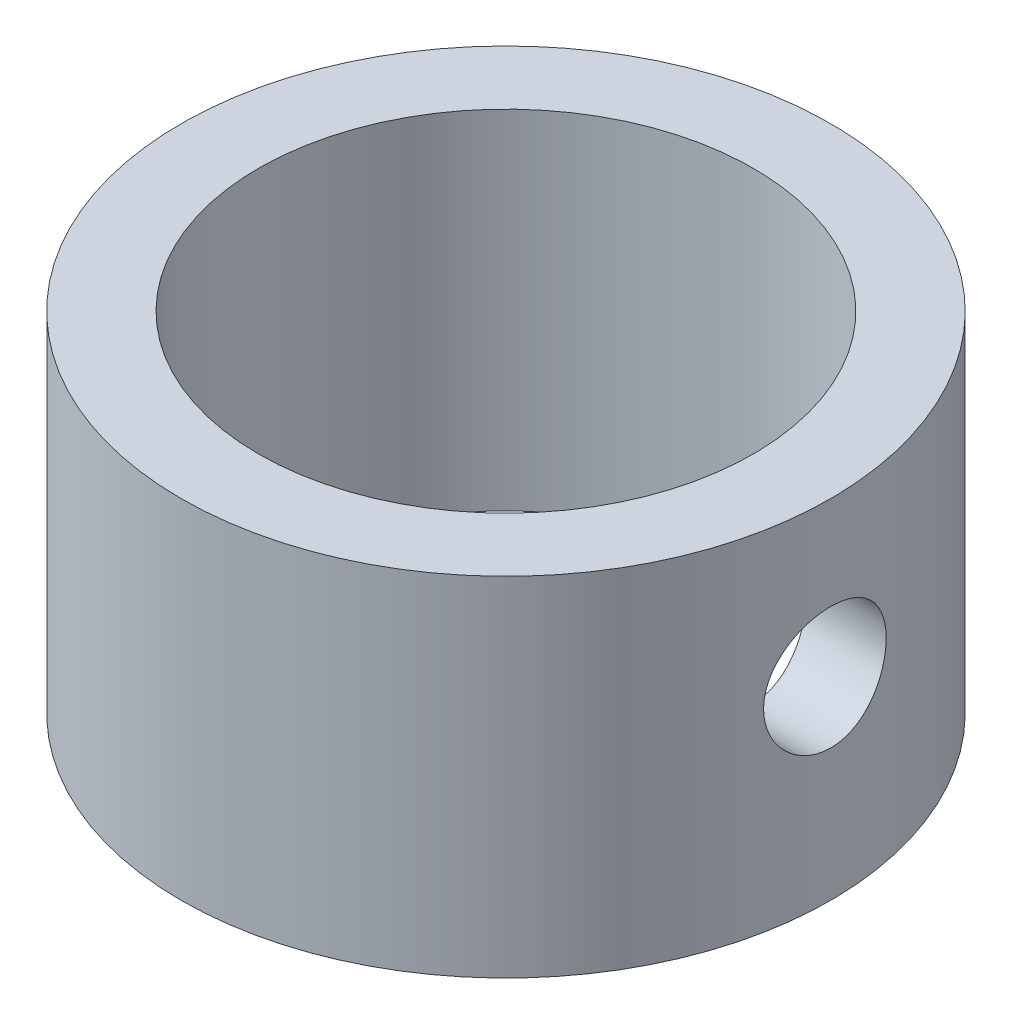
ISO-10303-21;
HEADER;
FILE_DESCRIPTION(('STEP AP214'),'2;1');
FILE_NAME('part.step','',(''),(''),'','','');
FILE_SCHEMA(('AUTOMOTIVE_DESIGN { 1 0 10303 214 1 1 1 1 }'));
ENDSEC;
DATA;
#1=APPLICATION_CONTEXT('core data for automotive mechanical design processes');
#2=APPLICATION_PROTOCOL_DEFINITION('international standard','automotive_design',2000,#1);
#3=PRODUCT_CONTEXT('',#1,'mechanical');
#4=PRODUCT('Part','Part','',(#3));
#5=PRODUCT_RELATED_PRODUCT_CATEGORY('part','',(#4));
#6=PRODUCT_DEFINITION_FORMATION('','',#4);
#7=PRODUCT_DEFINITION_CONTEXT('part definition',#1,'design');
#8=PRODUCT_DEFINITION('design','',#6,#7);
#9=PRODUCT_DEFINITION_SHAPE('','',#8);
#10=(LENGTH_UNIT() NAMED_UNIT(*) SI_UNIT(.MILLI.,.METRE.));
#11=(NAMED_UNIT(*) PLANE_ANGLE_UNIT() SI_UNIT($,.RADIAN.));
#12=(NAMED_UNIT(*) SI_UNIT($,.STERADIAN.) SOLID_ANGLE_UNIT());
#13=UNCERTAINTY_MEASURE_WITH_UNIT(LENGTH_MEASURE(1.E-05),#10,'distance_accuracy_value','');
#14=(GEOMETRIC_REPRESENTATION_CONTEXT(3) GLOBAL_UNCERTAINTY_ASSIGNED_CONTEXT((#13)) GLOBAL_UNIT_ASSIGNED_CONTEXT((#10,
#11,#12)) REPRESENTATION_CONTEXT('',''));
#15=CARTESIAN_POINT('',(0.,0.,0.));
#16=DIRECTION('',(0.,0.,1.));
#17=DIRECTION('',(1.,0.,0.));
#18=AXIS2_PLACEMENT_3D('',#15,#16,#17);
#19=CARTESIAN_POINT('',(0.,-1.25,0.));
#20=DIRECTION('',(0.,1.,0.));
#21=DIRECTION('',(0.,0.,1.));
#22=AXIS2_PLACEMENT_3D('',#19,#20,#21);
#23=CYLINDRICAL_SURFACE('',#22,2.1);
#24=CARTESIAN_POINT('',(2.06227880326594,0.,-0.396239999999993));
#25=CARTESIAN_POINT('',(2.06227923125293,0.0220433662998956,-0.396239157163966));
#26=CARTESIAN_POINT('',(2.06263606892465,0.0440976375763761,-0.394394305189756));
#27=CARTESIAN_POINT('',(2.06402305640468,0.0875841156718688,-0.387068724873467));
#28=CARTESIAN_POINT('',(2.06505377438345,0.109015781612206,-0.3815849283602));
#29=CARTESIAN_POINT('',(2.06766772536739,0.150621551652371,-0.367156018953373));
#30=CARTESIAN_POINT('',(2.06925044034742,0.170796813983742,-0.358214150456265));
#31=CARTESIAN_POINT('',(2.07278943938173,0.209359621584742,-0.33713154405698));
#32=CARTESIAN_POINT('',(2.07474569505206,0.227747302525837,-0.324991049179765));
#33=CARTESIAN_POINT('',(2.07883889070832,0.262446036871845,-0.297692739807474));
#34=CARTESIAN_POINT('',(2.08097762176098,0.278731292379627,-0.28250239734035));
#35=CARTESIAN_POINT('',(2.08517897298424,0.308538085477135,-0.249605888854275));
#36=CARTESIAN_POINT('',(2.08724158812009,0.32205944051432,-0.231899556787864));
#37=CARTESIAN_POINT('',(2.0910775051541,0.346053582309492,-0.194304111970412));
#38=CARTESIAN_POINT('',(2.09284845060321,0.356502028042994,-0.174399203288928));
#39=CARTESIAN_POINT('',(2.09588143610819,0.373896913663685,-0.133077521638642));
#40=CARTESIAN_POINT('',(2.09714351853459,0.380843645133426,-0.111660874719401));
#41=CARTESIAN_POINT('',(2.09900392469389,0.390958087536764,-0.0681910244703867));
#42=CARTESIAN_POINT('',(2.09960988239833,0.394169294501542,-0.0461482737928631));
#43=CARTESIAN_POINT('',(2.10011608130945,0.396857077131275,-0.00182911458913357));
#44=CARTESIAN_POINT('',(2.10001638333999,0.396333974674344,0.0204472736334566));
#45=CARTESIAN_POINT('',(2.09912846524647,0.391601311857938,0.0643030165408468));
#46=CARTESIAN_POINT('',(2.09834899306167,0.387438587646178,0.0858876282365805));
#47=CARTESIAN_POINT('',(2.09619892552423,0.37561894074816,0.128046377394059));
#48=CARTESIAN_POINT('',(2.09482830842762,0.367961889530189,0.148620477655358));
#49=CARTESIAN_POINT('',(2.09163535289751,0.349326432128582,0.188309826742431));
#50=CARTESIAN_POINT('',(2.08981048347841,0.338329337768601,0.207416088923615));
#51=CARTESIAN_POINT('',(2.08591077548498,0.313339736796762,0.243529548239943));
#52=CARTESIAN_POINT('',(2.08383591118947,0.299346921849537,0.260536529021685));
#53=CARTESIAN_POINT('',(2.07962795059652,0.268505098826812,0.292246201810245));
#54=CARTESIAN_POINT('',(2.07749445036021,0.251615114144883,0.30690901262132));
#55=CARTESIAN_POINT('',(2.07344045138472,0.215594805068189,0.333199917006207));
#56=CARTESIAN_POINT('',(2.07151995584133,0.196464447068942,0.344827965051644));
#57=CARTESIAN_POINT('',(2.06810880519369,0.156453147774011,0.364730857662425));
#58=CARTESIAN_POINT('',(2.06661890217287,0.135569224761366,0.372999845302882));
#59=CARTESIAN_POINT('',(2.06424909819484,0.0926740354964583,0.385900388309765));
#60=CARTESIAN_POINT('',(2.06336912717302,0.0706628990424363,0.390532361478425));
#61=CARTESIAN_POINT('',(2.06233269825866,0.0264978949053011,0.395969034907763));
#62=CARTESIAN_POINT('',(2.06216540468268,0.00435133073553325,0.396831059604532));
#63=CARTESIAN_POINT('',(2.06254426774915,-0.0397692751621675,0.394857085827068));
#64=CARTESIAN_POINT('',(2.06309038863542,-0.0617433254809282,0.392021272687679));
#65=CARTESIAN_POINT('',(2.06482444813135,-0.104706292344454,0.382781352369544));
#66=CARTESIAN_POINT('',(2.06600696932093,-0.125701921798904,0.376407350173828));
#67=CARTESIAN_POINT('',(2.06887591390094,-0.166327199741882,0.360303951888146));
#68=CARTESIAN_POINT('',(2.07056237483847,-0.185956746313089,0.350574305770453));
#69=CARTESIAN_POINT('',(2.07427382170856,-0.223545030803876,0.327904072745689));
#70=CARTESIAN_POINT('',(2.07630253198738,-0.241481572598169,0.314927304949609));
#71=CARTESIAN_POINT('',(2.08045944032922,-0.274943295893915,0.286179928094581));
#72=CARTESIAN_POINT('',(2.08258764744313,-0.290468257464607,0.270409064500716));
#73=CARTESIAN_POINT('',(2.08673860584373,-0.318880580206247,0.236265023639563));
#74=CARTESIAN_POINT('',(2.08875953840591,-0.331729369208098,0.217859493207284));
#75=CARTESIAN_POINT('',(2.09243754672949,-0.354152264139263,0.179117754808346));
#76=CARTESIAN_POINT('',(2.09409463662216,-0.363726497256899,0.158781621868191));
#77=CARTESIAN_POINT('',(2.09685043418937,-0.37927090179848,0.116862043136943));
#78=CARTESIAN_POINT('',(2.09795206028145,-0.385259941685175,0.0952857943323523));
#79=CARTESIAN_POINT('',(2.09948526271457,-0.393524130305366,0.0514108983330417));
#80=CARTESIAN_POINT('',(2.09991691049447,-0.395799675004997,0.0291123284172939));
#81=CARTESIAN_POINT('',(2.10006007596025,-0.396558349787066,-0.0152044638806005));
#82=CARTESIAN_POINT('',(2.0997826513855,-0.395099712575172,-0.0372216747516417));
#83=CARTESIAN_POINT('',(2.09856184704415,-0.388559063855942,-0.080691312331078));
#84=CARTESIAN_POINT('',(2.09761847383733,-0.383477088039509,-0.102143744600543));
#85=CARTESIAN_POINT('',(2.09517179462188,-0.369858685052617,-0.143843581692655));
#86=CARTESIAN_POINT('',(2.09366950572067,-0.361328530407602,-0.164093098412214));
#87=CARTESIAN_POINT('',(2.09026754035681,-0.341062924363763,-0.202882097857264));
#88=CARTESIAN_POINT('',(2.08836783682117,-0.329327254579577,-0.221421463958441));
#89=CARTESIAN_POINT('',(2.08434586749023,-0.302783677995271,-0.256553869633476));
#90=CARTESIAN_POINT('',(2.08222077682972,-0.287933738074362,-0.273114832198095));
#91=CARTESIAN_POINT('',(2.07800527458508,-0.255670298875599,-0.3035299470441));
#92=CARTESIAN_POINT('',(2.07591487127933,-0.238256197162265,-0.317383461440741));
#93=CARTESIAN_POINT('',(2.07198396247059,-0.201163087699288,-0.342112776249933));
#94=CARTESIAN_POINT('',(2.070145987708,-0.181464348692112,-0.352959395724986));
#95=CARTESIAN_POINT('',(2.06695852905594,-0.140495791799345,-0.371171959579202));
#96=CARTESIAN_POINT('',(2.06560858599796,-0.119227473475579,-0.378541177702762));
#97=CARTESIAN_POINT('',(2.06383041038064,-0.0815814128289868,-0.388098399358021));
#98=CARTESIAN_POINT('',(2.06325202696996,-0.0654235668940375,-0.39114624583049));
#99=CARTESIAN_POINT('',(2.06247606925361,-0.0328458275044431,-0.395217331991803));
#100=CARTESIAN_POINT('',(2.06227848434509,-0.0164259413588185,-0.396240628051761));
#101=CARTESIAN_POINT('',(2.06227880326594,0.,-0.396239999999993));
#102=B_SPLINE_CURVE_WITH_KNOTS('',3,(#24,#25,#26,#27,#28,#29,#30,#31,#32,#33,#34,#35,#36,#37,
#38,#39,#40,#41,#42,#43,#44,#45,#46,#47,#48,#49,#50,#51,#52,#53,#54,#55,#56,#57,#58,#59,#60,#61,
#62,#63,#64,#65,#66,#67,#68,#69,#70,#71,#72,#73,#74,#75,#76,#77,#78,#79,#80,#81,#82,#83,#84,#85,
#86,#87,#88,#89,#90,#91,#92,#93,#94,#95,#96,#97,#98,#99,#100,#101),.UNSPECIFIED.,.T.,.F.,(4,2,2,
2,2,2,2,2,2,2,2,2,2,2,2,2,2,2,2,2,2,2,2,2,2,2,2,2,2,2,2,2,2,2,2,2,2,2,4),(0.,0.0660699849348497,
0.132195747590222,0.198259620341526,0.264318475144296,0.331123373084555,0.397932681989042,
0.465257763398608,0.532577237822045,0.599104747263095,0.665626522446966,0.73130466206998,
0.796985217724573,0.863040258775692,0.929102101831482,0.996189741457499,1.06327838749354,
1.13048351365784,1.19768091849973,1.26385291121668,1.33002158753494,1.39563570564317,
1.46125471369046,1.52764024945011,1.59403183587324,1.66132264321463,1.72861083659021,
1.79554171330576,1.86246545278503,1.92835192862869,1.99423775548102,2.06000426601158,
2.12577525820153,2.19249880094421,2.25923804509746,2.3266039441582,2.39390629550498,
2.44314069565945,2.49237372492336),.UNSPECIFIED.);
#103=CARTESIAN_POINT('',(2.06227880326594,0.,-0.396239999999993));
#104=VERTEX_POINT('',#103);
#105=EDGE_CURVE('E61',#104,#104,#102,.T.);
#106=ORIENTED_EDGE('',*,*,#105,.F.);
#107=EDGE_LOOP('',(#106));
#108=FACE_BOUND('',#107,.T.);
#109=CARTESIAN_POINT('',(0.,-1.25,0.));
#110=DIRECTION('',(0.,1.,0.));
#111=DIRECTION('',(0.,0.,1.));
#112=AXIS2_PLACEMENT_3D('',#109,#110,#111);
#113=CIRCLE('',#112,2.1);
#114=CARTESIAN_POINT('',(0.,-1.25,2.1));
#115=VERTEX_POINT('',#114);
#116=EDGE_CURVE('E10',#115,#115,#113,.T.);
#117=ORIENTED_EDGE('',*,*,#116,.T.);
#118=EDGE_LOOP('',(#117));
#119=FACE_BOUND('',#118,.T.);
#120=CARTESIAN_POINT('',(0.,1.,0.));
#121=DIRECTION('',(0.,1.,0.));
#122=DIRECTION('',(0.,0.,1.));
#123=AXIS2_PLACEMENT_3D('',#120,#121,#122);
#124=CIRCLE('',#123,2.1);
#125=CARTESIAN_POINT('',(0.,1.,2.1));
#126=VERTEX_POINT('',#125);
#127=EDGE_CURVE('E50',#126,#126,#124,.T.);
#128=ORIENTED_EDGE('',*,*,#127,.F.);
#129=EDGE_LOOP('',(#128));
#130=FACE_BOUND('',#129,.T.);
#131=ADVANCED_FACE('F37',(#108,#119,#130),#23,.T.);
#132=CARTESIAN_POINT('',(0.,-1.25,0.));
#133=DIRECTION('',(0.,1.,0.));
#134=DIRECTION('',(0.,0.,1.));
#135=AXIS2_PLACEMENT_3D('',#132,#133,#134);
#136=PLANE('',#135);
#137=CARTESIAN_POINT('',(0.,-1.25,0.));
#138=DIRECTION('',(0.,1.,0.));
#139=DIRECTION('',(0.,0.,1.));
#140=AXIS2_PLACEMENT_3D('',#137,#138,#139);
#141=CIRCLE('',#140,1.6);
#142=CARTESIAN_POINT('',(0.,-1.25,1.6));
#143=VERTEX_POINT('',#142);
#144=EDGE_CURVE('E45',#143,#143,#141,.T.);
#145=ORIENTED_EDGE('',*,*,#144,.T.);
#146=EDGE_LOOP('',(#145));
#147=FACE_BOUND('',#146,.T.);
#148=ORIENTED_EDGE('',*,*,#116,.F.);
#149=EDGE_LOOP('',(#148));
#150=FACE_BOUND('',#149,.T.);
#151=ADVANCED_FACE('F87',(#147,#150),#136,.F.);
#152=CARTESIAN_POINT('',(0.,-1.25,0.));
#153=DIRECTION('',(0.,1.,0.));
#154=DIRECTION('',(0.,0.,1.));
#155=AXIS2_PLACEMENT_3D('',#152,#153,#154);
#156=CYLINDRICAL_SURFACE('',#155,1.6);
#157=CARTESIAN_POINT('',(1.55015930226542,0.,-0.396239999999993));
#158=CARTESIAN_POINT('',(1.55015972399969,0.0218876018071292,-0.396239366518361));
#159=CARTESIAN_POINT('',(1.55062792953695,0.0437822585424101,-0.394420274161994));
#160=CARTESIAN_POINT('',(1.55244548702833,0.0869433148388953,-0.387203276824768));
#161=CARTESIAN_POINT('',(1.55379536154469,0.108209333990534,-0.381803249406736));
#162=CARTESIAN_POINT('',(1.55721421216858,0.149482570866888,-0.36760947622991));
#163=CARTESIAN_POINT('',(1.55928227081277,0.169491356349373,-0.35882005876289));
#164=CARTESIAN_POINT('',(1.56390333246837,0.207752414864255,-0.338110129630693));
#165=CARTESIAN_POINT('',(1.56645635369509,0.226004621880331,-0.326189500350005));
#166=CARTESIAN_POINT('',(1.57182139730435,0.260628627304743,-0.299280569620755));
#167=CARTESIAN_POINT('',(1.57463749440787,0.276956898827732,-0.284237063229102));
#168=CARTESIAN_POINT('',(1.58017601388039,0.30688625002011,-0.251628337738299));
#169=CARTESIAN_POINT('',(1.58289842759721,0.320487078351863,-0.234062886494166));
#170=CARTESIAN_POINT('',(1.587987865442,0.344753082452166,-0.196611197885421));
#171=CARTESIAN_POINT('',(1.5903495203772,0.355375568713437,-0.176696508037337));
#172=CARTESIAN_POINT('',(1.59440489611166,0.37310589536193,-0.135295970967149));
#173=CARTESIAN_POINT('',(1.59609871355303,0.380214244314352,-0.113810351606548));
#174=CARTESIAN_POINT('',(1.59859876236334,0.390575297037941,-0.0703315370831292));
#175=CARTESIAN_POINT('',(1.59942198245252,0.393901898038103,-0.0483569454273978));
#176=CARTESIAN_POINT('',(1.60014725644046,0.39683691144627,-0.00414720315397493));
#177=CARTESIAN_POINT('',(1.60004944408286,0.396445863696048,0.0180879091650435));
#178=CARTESIAN_POINT('',(1.59895634716007,0.392009978726558,0.0616752469203937));
#179=CARTESIAN_POINT('',(1.59798065361831,0.388044897096853,0.0830361542186866));
#180=CARTESIAN_POINT('',(1.5952641955184,0.37670160787315,0.124779469702406));
#181=CARTESIAN_POINT('',(1.59352339066554,0.369323220515747,0.145161826289572));
#182=CARTESIAN_POINT('',(1.58944221601261,0.351297764462584,0.184580474024724));
#183=CARTESIAN_POINT('',(1.587096643999,0.340622167013111,0.203603158756642));
#184=CARTESIAN_POINT('',(1.58206059124552,0.316326942057251,0.239615092842785));
#185=CARTESIAN_POINT('',(1.57937005153771,0.302706810945769,0.256603993584675));
#186=CARTESIAN_POINT('',(1.5738531251791,0.272481053159185,0.288541674823237));
#187=CARTESIAN_POINT('',(1.57102502849099,0.255805720578549,0.303424260151516));
#188=CARTESIAN_POINT('',(1.56561726585836,0.220166371988486,0.330196381477162));
#189=CARTESIAN_POINT('',(1.56303761108698,0.201202253132209,0.342085782901365));
#190=CARTESIAN_POINT('',(1.55841280169508,0.161395640082454,0.362575361144891));
#191=CARTESIAN_POINT('',(1.5563702060723,0.140544767296739,0.371159877678002));
#192=CARTESIAN_POINT('',(1.55308378494609,0.0976330476029559,0.384681295447614));
#193=CARTESIAN_POINT('',(1.5518397921397,0.0755724551763999,0.38961896071233));
#194=CARTESIAN_POINT('',(1.55032646512169,0.0314806849591141,0.39559726079327));
#195=CARTESIAN_POINT('',(1.55003268822538,0.00946358481450672,0.396735650516526));
#196=CARTESIAN_POINT('',(1.55038656936618,-0.0344459992889853,0.395350474461188));
#197=CARTESIAN_POINT('',(1.55103414254121,-0.05633849430233,0.392827238775699));
#198=CARTESIAN_POINT('',(1.55317436310292,-0.099016249748749,0.384276082325219));
#199=CARTESIAN_POINT('',(1.55465333638939,-0.119813615408211,0.378304829189583));
#200=CARTESIAN_POINT('',(1.55827678301951,-0.160112228800685,0.363089851245188));
#201=CARTESIAN_POINT('',(1.56042133405278,-0.179613324903733,0.353845744394608));
#202=CARTESIAN_POINT('',(1.56518593932535,-0.217180731395141,0.332142010557311));
#203=CARTESIAN_POINT('',(1.56781436781438,-0.235212109503585,0.319623797492249));
#204=CARTESIAN_POINT('',(1.57322990645166,-0.268954215606929,0.291801477640296));
#205=CARTESIAN_POINT('',(1.57601704211759,-0.284664568948688,0.276496921978088));
#206=CARTESIAN_POINT('',(1.58151861467394,-0.313713334060285,0.243088217017703));
#207=CARTESIAN_POINT('',(1.58422959712248,-0.326984197962179,0.22492466086878));
#208=CARTESIAN_POINT('',(1.58920263356131,-0.35028729338041,0.186570026126999));
#209=CARTESIAN_POINT('',(1.59146471084446,-0.360319692951521,0.166379052814928));
#210=CARTESIAN_POINT('',(1.5952708804605,-0.376774790824869,0.12468159476139));
#211=CARTESIAN_POINT('',(1.59682008619746,-0.383223268208238,0.103185771977393));
#212=CARTESIAN_POINT('',(1.59904832485636,-0.392405155071775,0.059372216079307));
#213=CARTESIAN_POINT('',(1.59972752236124,-0.395139267219228,0.037054639241757));
#214=CARTESIAN_POINT('',(1.60013264430714,-0.396775906901424,-0.00713382546113772));
#215=CARTESIAN_POINT('',(1.59988339227434,-0.395778207166464,-0.0290008469218253));
#216=CARTESIAN_POINT('',(1.59851452062133,-0.390207644871066,-0.0722453421341921));
#217=CARTESIAN_POINT('',(1.59739492600557,-0.38563488502013,-0.0936228299317423));
#218=CARTESIAN_POINT('',(1.59441485291577,-0.373097096243508,-0.135179142254179));
#219=CARTESIAN_POINT('',(1.5925582515032,-0.365149804213861,-0.155363614243523));
#220=CARTESIAN_POINT('',(1.58829987393657,-0.346104696225216,-0.194123990748884));
#221=CARTESIAN_POINT('',(1.58589803020416,-0.335006489693108,-0.212699695476629));
#222=CARTESIAN_POINT('',(1.58073762828491,-0.309668630190889,-0.248189443315933));
#223=CARTESIAN_POINT('',(1.5779719949587,-0.295361080473383,-0.265053983585972));
#224=CARTESIAN_POINT('',(1.57242800577197,-0.264142909467115,-0.29617666034596));
#225=CARTESIAN_POINT('',(1.56964964687737,-0.247231632284159,-0.310434138116364));
#226=CARTESIAN_POINT('',(1.56433725816828,-0.210915243406767,-0.336192610410171));
#227=CARTESIAN_POINT('',(1.5618086007653,-0.191470316705876,-0.347638663866133));
#228=CARTESIAN_POINT('',(1.55735379372163,-0.15087248346122,-0.367082231677137));
#229=CARTESIAN_POINT('',(1.55542720013651,-0.129720849943118,-0.375082288665156));
#230=CARTESIAN_POINT('',(1.55270023606474,-0.0905010942659285,-0.386196559323211));
#231=CARTESIAN_POINT('',(1.5517544863409,-0.0726228495004225,-0.389954721845369));
#232=CARTESIAN_POINT('',(1.55048386901324,-0.0364980181739412,-0.394976604225404));
#233=CARTESIAN_POINT('',(1.55015895059295,-0.0182514618836683,-0.396240528242693));
#234=CARTESIAN_POINT('',(1.55015930226542,0.,-0.396239999999993));
#235=B_SPLINE_CURVE_WITH_KNOTS('',3,(#157,#158,#159,#160,#161,#162,#163,#164,#165,#166,#167,
#168,#169,#170,#171,#172,#173,#174,#175,#176,#177,#178,#179,#180,#181,#182,#183,#184,#185,#186,
#187,#188,#189,#190,#191,#192,#193,#194,#195,#196,#197,#198,#199,#200,#201,#202,#203,#204,#205,
#206,#207,#208,#209,#210,#211,#212,#213,#214,#215,#216,#217,#218,#219,#220,#221,#222,#223,#224,
#225,#226,#227,#228,#229,#230,#231,#232,#233,#234),.UNSPECIFIED.,.T.,.F.,(4,2,2,2,2,2,2,2,2,2,2,
2,2,2,2,2,2,2,2,2,2,2,2,2,2,2,2,2,2,2,2,2,2,2,2,2,2,2,4),(0.,0.065595791694688,
0.131230497117175,0.196781662322208,0.262335290131845,0.329165152624798,0.396001170754227,
0.463751192185205,0.531491405975245,0.597883876432254,0.664266706150247,0.729203888653425,
0.794144491494284,0.85966351968029,0.925193762496661,0.992465046018929,1.05973935350955,
1.12732862956593,1.19490374141064,1.26072616994385,1.32654266499733,1.3913070741877,
1.45607904585326,1.52210043407425,1.58813246766139,1.655782394518,1.72342881022845,
1.79058213197293,1.85772274817743,1.92308130115922,1.9884379764949,2.05345530158485,
2.11848068944963,2.18503918285842,2.25161447025678,2.31940245273905,2.38714033173378,
2.44184331425976,2.49654181902947),.UNSPECIFIED.);
#236=CARTESIAN_POINT('',(1.55015930226542,0.,-0.396239999999993));
#237=VERTEX_POINT('',#236);
#238=EDGE_CURVE('E69',#237,#237,#235,.T.);
#239=ORIENTED_EDGE('',*,*,#238,.T.);
#240=EDGE_LOOP('',(#239));
#241=FACE_BOUND('',#240,.T.);
#242=ORIENTED_EDGE('',*,*,#144,.F.);
#243=EDGE_LOOP('',(#242));
#244=FACE_BOUND('',#243,.T.);
#245=CARTESIAN_POINT('',(0.,1.,0.));
#246=DIRECTION('',(0.,1.,0.));
#247=DIRECTION('',(0.,0.,1.));
#248=AXIS2_PLACEMENT_3D('',#245,#246,#247);
#249=CIRCLE('',#248,1.6);
#250=CARTESIAN_POINT('',(0.,1.,1.6));
#251=VERTEX_POINT('',#250);
#252=EDGE_CURVE('E55',#251,#251,#249,.T.);
#253=ORIENTED_EDGE('',*,*,#252,.T.);
#254=EDGE_LOOP('',(#253));
#255=FACE_BOUND('',#254,.T.);
#256=ADVANCED_FACE('F84',(#241,#244,#255),#156,.F.);
#257=CARTESIAN_POINT('',(0.,1.,0.));
#258=DIRECTION('',(0.,1.,0.));
#259=DIRECTION('',(0.,0.,1.));
#260=AXIS2_PLACEMENT_3D('',#257,#258,#259);
#261=PLANE('',#260);
#262=ORIENTED_EDGE('',*,*,#127,.T.);
#263=EDGE_LOOP('',(#262));
#264=FACE_BOUND('',#263,.T.);
#265=ORIENTED_EDGE('',*,*,#252,.F.);
#266=EDGE_LOOP('',(#265));
#267=FACE_BOUND('',#266,.T.);
#268=ADVANCED_FACE('F77',(#264,#267),#261,.T.);
#269=CARTESIAN_POINT('',(2.1,0.,0.));
#270=DIRECTION('',(1.,0.,0.));
#271=DIRECTION('',(0.,0.,-1.));
#272=AXIS2_PLACEMENT_3D('',#269,#270,#271);
#273=CYLINDRICAL_SURFACE('',#272,0.396239999999993);
#274=ORIENTED_EDGE('',*,*,#105,.T.);
#275=EDGE_LOOP('',(#274));
#276=FACE_BOUND('',#275,.T.);
#277=ORIENTED_EDGE('',*,*,#238,.F.);
#278=EDGE_LOOP('',(#277));
#279=FACE_BOUND('',#278,.T.);
#280=ADVANCED_FACE('F74',(#276,#279),#273,.F.);
#281=CLOSED_SHELL('',(#131,#151,#256,#268,#280));
#282=MANIFOLD_SOLID_BREP('B2',#281);
#283=ADVANCED_BREP_SHAPE_REPRESENTATION('',(#18,#282),#14);
#284=SHAPE_DEFINITION_REPRESENTATION(#9,#283);
ENDSEC;
END-ISO-10303-21;
